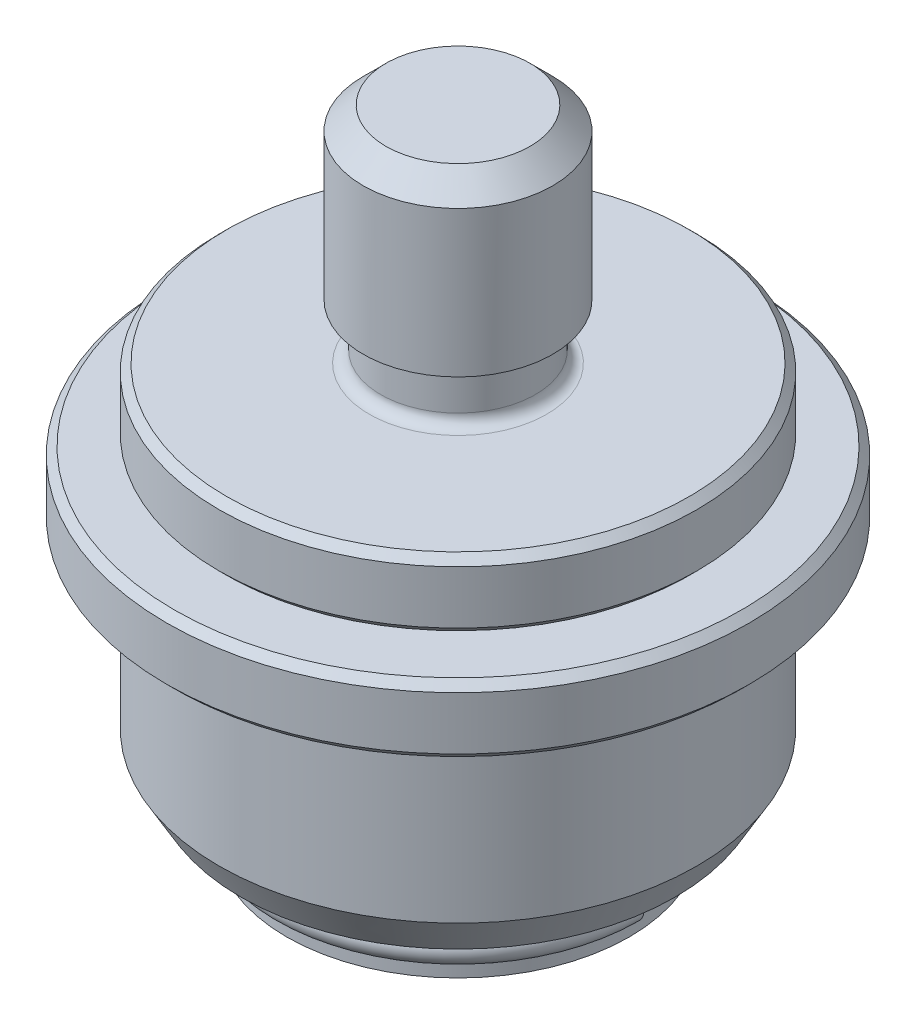
ISO-10303-21;
HEADER;
FILE_DESCRIPTION(('STEP AP214'),'2;1');
FILE_NAME('part.step','',(''),(''),'','','');
FILE_SCHEMA(('AUTOMOTIVE_DESIGN { 1 0 10303 214 1 1 1 1 }'));
ENDSEC;
DATA;
#1=APPLICATION_CONTEXT('core data for automotive mechanical design processes');
#2=APPLICATION_PROTOCOL_DEFINITION('international standard','automotive_design',2000,#1);
#3=PRODUCT_CONTEXT('',#1,'mechanical');
#4=PRODUCT('Part','Part','',(#3));
#5=PRODUCT_RELATED_PRODUCT_CATEGORY('part','',(#4));
#6=PRODUCT_DEFINITION_FORMATION('','',#4);
#7=PRODUCT_DEFINITION_CONTEXT('part definition',#1,'design');
#8=PRODUCT_DEFINITION('design','',#6,#7);
#9=PRODUCT_DEFINITION_SHAPE('','',#8);
#10=(LENGTH_UNIT() NAMED_UNIT(*) SI_UNIT(.MILLI.,.METRE.));
#11=(NAMED_UNIT(*) PLANE_ANGLE_UNIT() SI_UNIT($,.RADIAN.));
#12=(NAMED_UNIT(*) SI_UNIT($,.STERADIAN.) SOLID_ANGLE_UNIT());
#13=UNCERTAINTY_MEASURE_WITH_UNIT(LENGTH_MEASURE(1.E-05),#10,'distance_accuracy_value','');
#14=(GEOMETRIC_REPRESENTATION_CONTEXT(3) GLOBAL_UNCERTAINTY_ASSIGNED_CONTEXT((#13)) GLOBAL_UNIT_ASSIGNED_CONTEXT((#10,
#11,#12)) REPRESENTATION_CONTEXT('',''));
#15=CARTESIAN_POINT('',(0.,0.,0.));
#16=DIRECTION('',(0.,0.,1.));
#17=DIRECTION('',(1.,0.,0.));
#18=AXIS2_PLACEMENT_3D('',#15,#16,#17);
#19=CARTESIAN_POINT('',(0.,-25.5778,0.));
#20=DIRECTION('',(0.,1.,0.));
#21=DIRECTION('',(0.,0.,1.));
#22=AXIS2_PLACEMENT_3D('',#19,#20,#21);
#23=TOROIDAL_SURFACE('',#22,11.4808,0.9652);
#24=CARTESIAN_POINT('',(8.11815153344662,-25.5778,-8.11815153344642));
#25=DIRECTION('',(0.707106781186539,0.,0.707106781186556));
#26=DIRECTION('',(0.707106781186556,0.,-0.707106781186539));
#27=AXIS2_PLACEMENT_3D('',#24,#25,#26);
#28=CIRCLE('',#27,0.9652);
#29=CARTESIAN_POINT('',(8.80065099864788,-25.5778,-8.80065099864767));
#30=VERTEX_POINT('',#29);
#31=EDGE_CURVE('E11',#30,#30,#28,.T.);
#32=CARTESIAN_POINT('',(11.4808,-25.5778,0.));
#33=DIRECTION('',(0.,0.,1.));
#34=DIRECTION('',(1.,0.,0.));
#35=AXIS2_PLACEMENT_3D('',#32,#33,#34);
#36=CIRCLE('',#35,0.9652);
#37=CARTESIAN_POINT('',(12.446,-25.5778,0.));
#38=VERTEX_POINT('',#37);
#39=EDGE_CURVE('E44',#38,#38,#36,.T.);
#40=CARTESIAN_POINT('',(0.,-25.5778,0.));
#41=DIRECTION('',(0.,1.,0.));
#42=DIRECTION('',(0.,0.,1.));
#43=AXIS2_PLACEMENT_3D('',#40,#41,#42);
#44=CIRCLE('',#43,12.446);
#45=EDGE_CURVE('',#30,#38,#44,.T.);
#46=ORIENTED_EDGE('',*,*,#31,.F.);
#47=ORIENTED_EDGE('',*,*,#39,.T.);
#48=ORIENTED_EDGE('',*,*,#45,.T.);
#49=ORIENTED_EDGE('',*,*,#45,.F.);
#50=EDGE_LOOP('',(#46,#48,#47,#49));
#51=FACE_BOUND('',#50,.T.);
#52=ADVANCED_FACE('F38',(#51),#23,.T.);
#53=CARTESIAN_POINT('',(8.11815153344662,-25.5778,-8.11815153344642));
#54=DIRECTION('',(0.707106781186539,0.,0.707106781186556));
#55=DIRECTION('',(0.707106781186556,0.,-0.707106781186539));
#56=AXIS2_PLACEMENT_3D('',#53,#54,#55);
#57=PLANE('',#56);
#58=ORIENTED_EDGE('',*,*,#31,.T.);
#59=EDGE_LOOP('',(#58));
#60=FACE_BOUND('',#59,.T.);
#61=ADVANCED_FACE('F53',(#60),#57,.T.);
#62=CARTESIAN_POINT('',(11.4808,-25.5778,0.));
#63=DIRECTION('',(0.,0.,1.));
#64=DIRECTION('',(1.,0.,0.));
#65=AXIS2_PLACEMENT_3D('',#62,#63,#64);
#66=PLANE('',#65);
#67=ORIENTED_EDGE('',*,*,#39,.F.);
#68=EDGE_LOOP('',(#67));
#69=FACE_BOUND('',#68,.T.);
#70=ADVANCED_FACE('F51',(#69),#66,.F.);
#71=CLOSED_SHELL('',(#52,#61,#70));
#72=MANIFOLD_SOLID_BREP('B2',#71);
#73=CARTESIAN_POINT('',(19.5072,-4.826,0.));
#74=DIRECTION('',(0.,1.,0.));
#75=DIRECTION('',(0.,0.,1.));
#76=AXIS2_PLACEMENT_3D('',#73,#74,#75);
#77=PLANE('',#76);
#78=CARTESIAN_POINT('',(0.,-4.826,0.));
#79=DIRECTION('',(0.,1.,0.));
#80=DIRECTION('',(0.,0.,1.));
#81=AXIS2_PLACEMENT_3D('',#78,#79,#80);
#82=CIRCLE('',#81,18.9992);
#83=CARTESIAN_POINT('',(0.,-4.826,18.9992));
#84=VERTEX_POINT('',#83);
#85=EDGE_CURVE('E93',#84,#84,#82,.T.);
#86=ORIENTED_EDGE('',*,*,#85,.T.);
#87=EDGE_LOOP('',(#86));
#88=FACE_BOUND('',#87,.T.);
#89=CARTESIAN_POINT('',(0.,-4.826,0.));
#90=DIRECTION('',(0.,-1.,0.));
#91=DIRECTION('',(0.,0.,-1.));
#92=AXIS2_PLACEMENT_3D('',#89,#90,#91);
#93=CIRCLE('',#92,11.5316);
#94=CARTESIAN_POINT('',(0.,-4.826,-11.5316));
#95=VERTEX_POINT('',#94);
#96=EDGE_CURVE('E106',#95,#95,#93,.T.);
#97=ORIENTED_EDGE('',*,*,#96,.T.);
#98=EDGE_LOOP('',(#97));
#99=FACE_BOUND('',#98,.T.);
#100=ADVANCED_FACE('F86',(#88,#99),#77,.T.);
#101=CARTESIAN_POINT('',(0.,0.,0.));
#102=DIRECTION('',(0.,-1.,0.));
#103=DIRECTION('',(0.,0.,-1.));
#104=AXIS2_PLACEMENT_3D('',#101,#102,#103);
#105=CYLINDRICAL_SURFACE('',#104,11.5316);
#106=CARTESIAN_POINT('',(0.,-20.7264,0.));
#107=DIRECTION('',(0.,-1.,0.));
#108=DIRECTION('',(0.,0.,-1.));
#109=AXIS2_PLACEMENT_3D('',#106,#107,#108);
#110=CIRCLE('',#109,11.5316);
#111=CARTESIAN_POINT('',(0.,-20.7264,-11.5316));
#112=VERTEX_POINT('',#111);
#113=EDGE_CURVE('E109',#112,#112,#110,.T.);
#114=ORIENTED_EDGE('',*,*,#113,.T.);
#115=EDGE_LOOP('',(#114));
#116=FACE_BOUND('',#115,.T.);
#117=ORIENTED_EDGE('',*,*,#96,.F.);
#118=EDGE_LOOP('',(#117));
#119=FACE_BOUND('',#118,.T.);
#120=ADVANCED_FACE('F151',(#116,#119),#105,.F.);
#121=CARTESIAN_POINT('',(12.192,-20.7264,0.));
#122=DIRECTION('',(0.,-1.,0.));
#123=DIRECTION('',(0.,0.,-1.));
#124=AXIS2_PLACEMENT_3D('',#121,#122,#123);
#125=PLANE('',#124);
#126=CARTESIAN_POINT('',(0.,-20.7264,0.));
#127=DIRECTION('',(0.,-1.,0.));
#128=DIRECTION('',(0.,0.,-1.));
#129=AXIS2_PLACEMENT_3D('',#126,#127,#128);
#130=CIRCLE('',#129,12.192);
#131=CARTESIAN_POINT('',(0.,-20.7264,-12.192));
#132=VERTEX_POINT('',#131);
#133=EDGE_CURVE('E112',#132,#132,#130,.T.);
#134=ORIENTED_EDGE('',*,*,#133,.T.);
#135=EDGE_LOOP('',(#134));
#136=FACE_BOUND('',#135,.T.);
#137=ORIENTED_EDGE('',*,*,#113,.F.);
#138=EDGE_LOOP('',(#137));
#139=FACE_BOUND('',#138,.T.);
#140=ADVANCED_FACE('F156',(#136,#139),#125,.T.);
#141=CARTESIAN_POINT('',(0.,-21.7424,0.));
#142=DIRECTION('',(0.,-1.,0.));
#143=DIRECTION('',(0.,0.,-1.));
#144=AXIS2_PLACEMENT_3D('',#141,#142,#143);
#145=TOROIDAL_SURFACE('',#144,12.192,1.016);
#146=CARTESIAN_POINT('',(0.,-21.7424,0.));
#147=DIRECTION('',(0.,-1.,0.));
#148=DIRECTION('',(0.,0.,-1.));
#149=AXIS2_PLACEMENT_3D('',#146,#147,#148);
#150=CIRCLE('',#149,13.208);
#151=CARTESIAN_POINT('',(0.,-21.7424,-13.208));
#152=VERTEX_POINT('',#151);
#153=EDGE_CURVE('E115',#152,#152,#150,.T.);
#154=ORIENTED_EDGE('',*,*,#153,.T.);
#155=EDGE_LOOP('',(#154));
#156=FACE_BOUND('',#155,.T.);
#157=ORIENTED_EDGE('',*,*,#133,.F.);
#158=EDGE_LOOP('',(#157));
#159=FACE_BOUND('',#158,.T.);
#160=ADVANCED_FACE('F238',(#156,#159),#145,.F.);
#161=CARTESIAN_POINT('',(0.,0.,0.));
#162=DIRECTION('',(0.,-1.,0.));
#163=DIRECTION('',(0.,0.,-1.));
#164=AXIS2_PLACEMENT_3D('',#161,#162,#163);
#165=CYLINDRICAL_SURFACE('',#164,13.208);
#166=CARTESIAN_POINT('',(0.,-23.7236,0.));
#167=DIRECTION('',(0.,-1.,0.));
#168=DIRECTION('',(0.,0.,-1.));
#169=AXIS2_PLACEMENT_3D('',#166,#167,#168);
#170=CIRCLE('',#169,13.208);
#171=CARTESIAN_POINT('',(0.,-23.7236,-13.208));
#172=VERTEX_POINT('',#171);
#173=EDGE_CURVE('E118',#172,#172,#170,.T.);
#174=ORIENTED_EDGE('',*,*,#173,.T.);
#175=EDGE_LOOP('',(#174));
#176=FACE_BOUND('',#175,.T.);
#177=ORIENTED_EDGE('',*,*,#153,.F.);
#178=EDGE_LOOP('',(#177));
#179=FACE_BOUND('',#178,.T.);
#180=ADVANCED_FACE('F228',(#176,#179),#165,.F.);
#181=CARTESIAN_POINT('',(13.208,-23.7236,0.));
#182=DIRECTION('',(0.,-1.,0.));
#183=DIRECTION('',(0.,0.,-1.));
#184=AXIS2_PLACEMENT_3D('',#181,#182,#183);
#185=PLANE('',#184);
#186=CARTESIAN_POINT('',(0.,-23.7236,0.));
#187=DIRECTION('',(0.,-1.,0.));
#188=DIRECTION('',(0.,0.,-1.));
#189=AXIS2_PLACEMENT_3D('',#186,#187,#188);
#190=CIRCLE('',#189,14.5355303162583);
#191=CARTESIAN_POINT('',(0.,-23.7236,-14.5355303162583));
#192=VERTEX_POINT('',#191);
#193=EDGE_CURVE('E121',#192,#192,#190,.T.);
#194=ORIENTED_EDGE('',*,*,#193,.T.);
#195=EDGE_LOOP('',(#194));
#196=FACE_BOUND('',#195,.T.);
#197=ORIENTED_EDGE('',*,*,#173,.F.);
#198=EDGE_LOOP('',(#197));
#199=FACE_BOUND('',#198,.T.);
#200=ADVANCED_FACE('F218',(#196,#199),#185,.T.);
#201=CARTESIAN_POINT('',(0.,-23.7236,0.));
#202=DIRECTION('',(0.,1.,0.));
#203=DIRECTION('',(0.,0.,1.));
#204=AXIS2_PLACEMENT_3D('',#201,#202,#203);
#205=CONICAL_SURFACE('',#204,14.5355303162583,0.523598775598301);
#206=CARTESIAN_POINT('',(0.,-21.1836,0.));
#207=DIRECTION('',(0.,-1.,0.));
#208=DIRECTION('',(0.,0.,-1.));
#209=AXIS2_PLACEMENT_3D('',#206,#207,#208);
#210=CIRCLE('',#209,16.002);
#211=CARTESIAN_POINT('',(0.,-21.1836,-16.002));
#212=VERTEX_POINT('',#211);
#213=EDGE_CURVE('E124',#212,#212,#210,.T.);
#214=ORIENTED_EDGE('',*,*,#213,.T.);
#215=EDGE_LOOP('',(#214));
#216=FACE_BOUND('',#215,.T.);
#217=ORIENTED_EDGE('',*,*,#193,.F.);
#218=EDGE_LOOP('',(#217));
#219=FACE_BOUND('',#218,.T.);
#220=ADVANCED_FACE('F208',(#216,#219),#205,.T.);
#221=CARTESIAN_POINT('',(0.,0.,0.));
#222=DIRECTION('',(0.,-1.,0.));
#223=DIRECTION('',(0.,0.,-1.));
#224=AXIS2_PLACEMENT_3D('',#221,#222,#223);
#225=CYLINDRICAL_SURFACE('',#224,16.002);
#226=CARTESIAN_POINT('',(0.,-10.16,0.));
#227=DIRECTION('',(0.,-1.,0.));
#228=DIRECTION('',(0.,0.,-1.));
#229=AXIS2_PLACEMENT_3D('',#226,#227,#228);
#230=CIRCLE('',#229,16.002);
#231=CARTESIAN_POINT('',(0.,-10.16,-16.002));
#232=VERTEX_POINT('',#231);
#233=EDGE_CURVE('E127',#232,#232,#230,.T.);
#234=ORIENTED_EDGE('',*,*,#233,.T.);
#235=EDGE_LOOP('',(#234));
#236=FACE_BOUND('',#235,.T.);
#237=ORIENTED_EDGE('',*,*,#213,.F.);
#238=EDGE_LOOP('',(#237));
#239=FACE_BOUND('',#238,.T.);
#240=ADVANCED_FACE('F148',(#236,#239),#225,.T.);
#241=CARTESIAN_POINT('',(0.,-10.16,0.));
#242=DIRECTION('',(0.,-1.,0.));
#243=DIRECTION('',(0.,0.,-1.));
#244=AXIS2_PLACEMENT_3D('',#241,#242,#243);
#245=TOROIDAL_SURFACE('',#244,16.764,0.762);
#246=CARTESIAN_POINT('',(0.,-9.398,0.));
#247=DIRECTION('',(0.,-1.,0.));
#248=DIRECTION('',(0.,0.,-1.));
#249=AXIS2_PLACEMENT_3D('',#246,#247,#248);
#250=CIRCLE('',#249,16.764);
#251=CARTESIAN_POINT('',(0.,-9.398,-16.764));
#252=VERTEX_POINT('',#251);
#253=EDGE_CURVE('E130',#252,#252,#250,.T.);
#254=ORIENTED_EDGE('',*,*,#253,.T.);
#255=EDGE_LOOP('',(#254));
#256=FACE_BOUND('',#255,.T.);
#257=ORIENTED_EDGE('',*,*,#233,.F.);
#258=EDGE_LOOP('',(#257));
#259=FACE_BOUND('',#258,.T.);
#260=ADVANCED_FACE('F134',(#256,#259),#245,.F.);
#261=CARTESIAN_POINT('',(16.764,-9.398,0.));
#262=DIRECTION('',(0.,-1.,0.));
#263=DIRECTION('',(0.,0.,-1.));
#264=AXIS2_PLACEMENT_3D('',#261,#262,#263);
#265=PLANE('',#264);
#266=CARTESIAN_POINT('',(0.,-9.398,0.));
#267=DIRECTION('',(0.,-1.,0.));
#268=DIRECTION('',(0.,0.,-1.));
#269=AXIS2_PLACEMENT_3D('',#266,#267,#268);
#270=CIRCLE('',#269,18.9992);
#271=CARTESIAN_POINT('',(0.,-9.398,-18.9992));
#272=VERTEX_POINT('',#271);
#273=EDGE_CURVE('E37',#272,#272,#270,.T.);
#274=ORIENTED_EDGE('',*,*,#273,.T.);
#275=EDGE_LOOP('',(#274));
#276=FACE_BOUND('',#275,.T.);
#277=ORIENTED_EDGE('',*,*,#253,.F.);
#278=EDGE_LOOP('',(#277));
#279=FACE_BOUND('',#278,.T.);
#280=ADVANCED_FACE('F137',(#276,#279),#265,.T.);
#281=CARTESIAN_POINT('',(0.,0.,0.));
#282=DIRECTION('',(0.,-1.,0.));
#283=DIRECTION('',(0.,0.,-1.));
#284=AXIS2_PLACEMENT_3D('',#281,#282,#283);
#285=CYLINDRICAL_SURFACE('',#284,19.5072);
#286=CARTESIAN_POINT('',(0.,-5.334,0.));
#287=DIRECTION('',(0.,1.,0.));
#288=DIRECTION('',(0.,0.,1.));
#289=AXIS2_PLACEMENT_3D('',#286,#287,#288);
#290=CIRCLE('',#289,19.5072);
#291=CARTESIAN_POINT('',(0.,-5.334,19.5072));
#292=VERTEX_POINT('',#291);
#293=EDGE_CURVE('E97',#292,#292,#290,.F.);
#294=ORIENTED_EDGE('',*,*,#293,.T.);
#295=EDGE_LOOP('',(#294));
#296=FACE_BOUND('',#295,.T.);
#297=CARTESIAN_POINT('',(0.,-8.89,0.));
#298=DIRECTION('',(0.,-1.,0.));
#299=DIRECTION('',(0.,0.,-1.));
#300=AXIS2_PLACEMENT_3D('',#297,#298,#299);
#301=CIRCLE('',#300,19.5072);
#302=CARTESIAN_POINT('',(0.,-8.89,-19.5072));
#303=VERTEX_POINT('',#302);
#304=EDGE_CURVE('E101',#303,#303,#301,.F.);
#305=ORIENTED_EDGE('',*,*,#304,.T.);
#306=EDGE_LOOP('',(#305));
#307=FACE_BOUND('',#306,.T.);
#308=ADVANCED_FACE('F139',(#296,#307),#285,.T.);
#309=CARTESIAN_POINT('',(0.,-5.334,0.));
#310=DIRECTION('',(0.,-1.,0.));
#311=DIRECTION('',(0.,0.,-1.));
#312=AXIS2_PLACEMENT_3D('',#309,#310,#311);
#313=CONICAL_SURFACE('',#312,19.5072,0.785398163397455);
#314=ORIENTED_EDGE('',*,*,#85,.F.);
#315=EDGE_LOOP('',(#314));
#316=FACE_BOUND('',#315,.T.);
#317=ORIENTED_EDGE('',*,*,#293,.F.);
#318=EDGE_LOOP('',(#317));
#319=FACE_BOUND('',#318,.T.);
#320=ADVANCED_FACE('F145',(#316,#319),#313,.T.);
#321=CARTESIAN_POINT('',(0.,-9.398,0.));
#322=DIRECTION('',(0.,1.,0.));
#323=DIRECTION('',(0.,0.,1.));
#324=AXIS2_PLACEMENT_3D('',#321,#322,#323);
#325=CONICAL_SURFACE('',#324,18.9992,0.785398163397448);
#326=ORIENTED_EDGE('',*,*,#304,.F.);
#327=EDGE_LOOP('',(#326));
#328=FACE_BOUND('',#327,.T.);
#329=ORIENTED_EDGE('',*,*,#273,.F.);
#330=EDGE_LOOP('',(#329));
#331=FACE_BOUND('',#330,.T.);
#332=ADVANCED_FACE('F88',(#328,#331),#325,.T.);
#333=CLOSED_SHELL('',(#100,#120,#140,#160,#180,#200,#220,#240,#260,#280,#308,#320,#332));
#334=MANIFOLD_SOLID_BREP('B6',#333);
#335=CARTESIAN_POINT('',(0.,14.986,0.));
#336=DIRECTION('',(0.,1.,0.));
#337=DIRECTION('',(0.,0.,1.));
#338=AXIS2_PLACEMENT_3D('',#335,#336,#337);
#339=PLANE('',#338);
#340=CARTESIAN_POINT('',(0.,14.986,0.));
#341=DIRECTION('',(0.,1.,0.));
#342=DIRECTION('',(0.,0.,1.));
#343=AXIS2_PLACEMENT_3D('',#340,#341,#342);
#344=CIRCLE('',#343,4.826);
#345=CARTESIAN_POINT('',(0.,14.986,4.826));
#346=VERTEX_POINT('',#345);
#347=EDGE_CURVE('E85',#346,#346,#344,.T.);
#348=ORIENTED_EDGE('',*,*,#347,.T.);
#349=EDGE_LOOP('',(#348));
#350=FACE_BOUND('',#349,.T.);
#351=ADVANCED_FACE('F283',(#350),#339,.T.);
#352=CARTESIAN_POINT('',(0.,14.986,0.));
#353=DIRECTION('',(0.,-1.,0.));
#354=DIRECTION('',(0.,0.,-1.));
#355=AXIS2_PLACEMENT_3D('',#352,#353,#354);
#356=CYLINDRICAL_SURFACE('',#355,6.35);
#357=CARTESIAN_POINT('',(0.,13.462,0.));
#358=DIRECTION('',(0.,1.,0.));
#359=DIRECTION('',(0.,0.,1.));
#360=AXIS2_PLACEMENT_3D('',#357,#358,#359);
#361=CIRCLE('',#360,6.35);
#362=CARTESIAN_POINT('',(0.,13.462,6.35));
#363=VERTEX_POINT('',#362);
#364=EDGE_CURVE('E290',#363,#363,#361,.F.);
#365=ORIENTED_EDGE('',*,*,#364,.T.);
#366=EDGE_LOOP('',(#365));
#367=FACE_BOUND('',#366,.T.);
#368=CARTESIAN_POINT('',(0.,3.683,0.));
#369=DIRECTION('',(0.,-1.,0.));
#370=DIRECTION('',(0.,0.,-1.));
#371=AXIS2_PLACEMENT_3D('',#368,#369,#370);
#372=CIRCLE('',#371,6.35);
#373=CARTESIAN_POINT('',(0.,3.683,-6.35));
#374=VERTEX_POINT('',#373);
#375=EDGE_CURVE('E309',#374,#374,#372,.T.);
#376=ORIENTED_EDGE('',*,*,#375,.F.);
#377=EDGE_LOOP('',(#376));
#378=FACE_BOUND('',#377,.T.);
#379=ADVANCED_FACE('F363',(#367,#378),#356,.T.);
#380=CARTESIAN_POINT('',(6.35,3.683,0.));
#381=DIRECTION('',(0.,-1.,0.));
#382=DIRECTION('',(0.,0.,-1.));
#383=AXIS2_PLACEMENT_3D('',#380,#381,#382);
#384=PLANE('',#383);
#385=ORIENTED_EDGE('',*,*,#375,.T.);
#386=EDGE_LOOP('',(#385));
#387=FACE_BOUND('',#386,.T.);
#388=CARTESIAN_POINT('',(0.,3.683,0.));
#389=DIRECTION('',(0.,-1.,0.));
#390=DIRECTION('',(0.,0.,-1.));
#391=AXIS2_PLACEMENT_3D('',#388,#389,#390);
#392=CIRCLE('',#391,5.1816);
#393=CARTESIAN_POINT('',(0.,3.683,-5.1816));
#394=VERTEX_POINT('',#393);
#395=EDGE_CURVE('E312',#394,#394,#392,.T.);
#396=ORIENTED_EDGE('',*,*,#395,.F.);
#397=EDGE_LOOP('',(#396));
#398=FACE_BOUND('',#397,.T.);
#399=ADVANCED_FACE('F368',(#387,#398),#384,.T.);
#400=CARTESIAN_POINT('',(0.,14.986,0.));
#401=DIRECTION('',(0.,-1.,0.));
#402=DIRECTION('',(0.,0.,-1.));
#403=AXIS2_PLACEMENT_3D('',#400,#401,#402);
#404=CYLINDRICAL_SURFACE('',#403,5.1816);
#405=ORIENTED_EDGE('',*,*,#395,.T.);
#406=EDGE_LOOP('',(#405));
#407=FACE_BOUND('',#406,.T.);
#408=CARTESIAN_POINT('',(0.,0.762000000000006,0.));
#409=DIRECTION('',(0.,-1.,0.));
#410=DIRECTION('',(0.,0.,-1.));
#411=AXIS2_PLACEMENT_3D('',#408,#409,#410);
#412=CIRCLE('',#411,5.1816);
#413=CARTESIAN_POINT('',(0.,0.762000000000006,-5.1816));
#414=VERTEX_POINT('',#413);
#415=EDGE_CURVE('E315',#414,#414,#412,.T.);
#416=ORIENTED_EDGE('',*,*,#415,.F.);
#417=EDGE_LOOP('',(#416));
#418=FACE_BOUND('',#417,.T.);
#419=ADVANCED_FACE('F405',(#407,#418),#404,.T.);
#420=CARTESIAN_POINT('',(0.,0.762,0.));
#421=DIRECTION('',(0.,-1.,0.));
#422=DIRECTION('',(0.,0.,-1.));
#423=AXIS2_PLACEMENT_3D('',#420,#421,#422);
#424=TOROIDAL_SURFACE('',#423,5.9436,0.762);
#425=ORIENTED_EDGE('',*,*,#415,.T.);
#426=EDGE_LOOP('',(#425));
#427=FACE_BOUND('',#426,.T.);
#428=CARTESIAN_POINT('',(0.,0.,0.));
#429=DIRECTION('',(0.,-1.,0.));
#430=DIRECTION('',(0.,0.,-1.));
#431=AXIS2_PLACEMENT_3D('',#428,#429,#430);
#432=CIRCLE('',#431,5.94360000000001);
#433=CARTESIAN_POINT('',(0.,0.,-5.94360000000001));
#434=VERTEX_POINT('',#433);
#435=EDGE_CURVE('E318',#434,#434,#432,.T.);
#436=ORIENTED_EDGE('',*,*,#435,.F.);
#437=EDGE_LOOP('',(#436));
#438=FACE_BOUND('',#437,.T.);
#439=ADVANCED_FACE('F398',(#427,#438),#424,.F.);
#440=CARTESIAN_POINT('',(5.94360000000001,0.,0.));
#441=DIRECTION('',(0.,1.,0.));
#442=DIRECTION('',(0.,0.,1.));
#443=AXIS2_PLACEMENT_3D('',#440,#441,#442);
#444=PLANE('',#443);
#445=CARTESIAN_POINT('',(0.,0.,0.));
#446=DIRECTION('',(0.,1.,0.));
#447=DIRECTION('',(0.,0.,1.));
#448=AXIS2_PLACEMENT_3D('',#445,#446,#447);
#449=CIRCLE('',#448,15.494);
#450=CARTESIAN_POINT('',(0.,0.,15.494));
#451=VERTEX_POINT('',#450);
#452=EDGE_CURVE('E294',#451,#451,#449,.T.);
#453=ORIENTED_EDGE('',*,*,#452,.T.);
#454=EDGE_LOOP('',(#453));
#455=FACE_BOUND('',#454,.T.);
#456=ORIENTED_EDGE('',*,*,#435,.T.);
#457=EDGE_LOOP('',(#456));
#458=FACE_BOUND('',#457,.T.);
#459=ADVANCED_FACE('F388',(#455,#458),#444,.T.);
#460=CARTESIAN_POINT('',(0.,14.986,0.));
#461=DIRECTION('',(0.,-1.,0.));
#462=DIRECTION('',(0.,0.,-1.));
#463=AXIS2_PLACEMENT_3D('',#460,#461,#462);
#464=CYLINDRICAL_SURFACE('',#463,16.002);
#465=CARTESIAN_POINT('',(0.,-4.06399999999998,0.));
#466=DIRECTION('',(0.,-1.,0.));
#467=DIRECTION('',(0.,0.,-1.));
#468=AXIS2_PLACEMENT_3D('',#465,#466,#467);
#469=CIRCLE('',#468,16.002);
#470=CARTESIAN_POINT('',(0.,-4.06399999999998,-16.002));
#471=VERTEX_POINT('',#470);
#472=EDGE_CURVE('E298',#471,#471,#469,.F.);
#473=ORIENTED_EDGE('',*,*,#472,.T.);
#474=EDGE_LOOP('',(#473));
#475=FACE_BOUND('',#474,.T.);
#476=CARTESIAN_POINT('',(0.,-0.507999999999991,0.));
#477=DIRECTION('',(0.,1.,0.));
#478=DIRECTION('',(0.,0.,1.));
#479=AXIS2_PLACEMENT_3D('',#476,#477,#478);
#480=CIRCLE('',#479,16.002);
#481=CARTESIAN_POINT('',(0.,-0.507999999999991,16.002));
#482=VERTEX_POINT('',#481);
#483=EDGE_CURVE('E303',#482,#482,#480,.F.);
#484=ORIENTED_EDGE('',*,*,#483,.T.);
#485=EDGE_LOOP('',(#484));
#486=FACE_BOUND('',#485,.T.);
#487=ADVANCED_FACE('F385',(#475,#486),#464,.T.);
#488=CARTESIAN_POINT('',(16.002,-4.572,0.));
#489=DIRECTION('',(0.,-1.,0.));
#490=DIRECTION('',(0.,0.,-1.));
#491=AXIS2_PLACEMENT_3D('',#488,#489,#490);
#492=PLANE('',#491);
#493=CARTESIAN_POINT('',(0.,-4.572,0.));
#494=DIRECTION('',(0.,-1.,0.));
#495=DIRECTION('',(0.,0.,-1.));
#496=AXIS2_PLACEMENT_3D('',#493,#494,#495);
#497=CIRCLE('',#496,15.494);
#498=CARTESIAN_POINT('',(0.,-4.572,-15.494));
#499=VERTEX_POINT('',#498);
#500=EDGE_CURVE('E306',#499,#499,#497,.T.);
#501=ORIENTED_EDGE('',*,*,#500,.T.);
#502=EDGE_LOOP('',(#501));
#503=FACE_BOUND('',#502,.T.);
#504=CARTESIAN_POINT('',(0.,-4.572,0.));
#505=DIRECTION('',(0.,-1.,0.));
#506=DIRECTION('',(0.,0.,-1.));
#507=AXIS2_PLACEMENT_3D('',#504,#505,#506);
#508=CIRCLE('',#507,11.4808);
#509=CARTESIAN_POINT('',(0.,-4.572,-11.4808));
#510=VERTEX_POINT('',#509);
#511=EDGE_CURVE('E321',#510,#510,#508,.T.);
#512=ORIENTED_EDGE('',*,*,#511,.F.);
#513=EDGE_LOOP('',(#512));
#514=FACE_BOUND('',#513,.T.);
#515=ADVANCED_FACE('F387',(#503,#514),#492,.T.);
#516=CARTESIAN_POINT('',(0.,14.986,0.));
#517=DIRECTION('',(0.,-1.,0.));
#518=DIRECTION('',(0.,0.,-1.));
#519=AXIS2_PLACEMENT_3D('',#516,#517,#518);
#520=CYLINDRICAL_SURFACE('',#519,11.4808);
#521=ORIENTED_EDGE('',*,*,#511,.T.);
#522=EDGE_LOOP('',(#521));
#523=FACE_BOUND('',#522,.T.);
#524=CARTESIAN_POINT('',(0.,-24.5618,0.));
#525=DIRECTION('',(0.,-1.,0.));
#526=DIRECTION('',(0.,0.,-1.));
#527=AXIS2_PLACEMENT_3D('',#524,#525,#526);
#528=CIRCLE('',#527,11.4808);
#529=CARTESIAN_POINT('',(0.,-24.5618,-11.4808));
#530=VERTEX_POINT('',#529);
#531=EDGE_CURVE('E324',#530,#530,#528,.T.);
#532=ORIENTED_EDGE('',*,*,#531,.F.);
#533=EDGE_LOOP('',(#532));
#534=FACE_BOUND('',#533,.T.);
#535=ADVANCED_FACE('F395',(#523,#534),#520,.T.);
#536=CARTESIAN_POINT('',(0.,-25.5778,0.));
#537=DIRECTION('',(0.,-1.,0.));
#538=DIRECTION('',(0.,0.,-1.));
#539=AXIS2_PLACEMENT_3D('',#536,#537,#538);
#540=TOROIDAL_SURFACE('',#539,11.4808,1.016);
#541=ORIENTED_EDGE('',*,*,#531,.T.);
#542=EDGE_LOOP('',(#541));
#543=FACE_BOUND('',#542,.T.);
#544=CARTESIAN_POINT('',(0.,-26.5938,0.));
#545=DIRECTION('',(0.,-1.,0.));
#546=DIRECTION('',(0.,0.,-1.));
#547=AXIS2_PLACEMENT_3D('',#544,#545,#546);
#548=CIRCLE('',#547,11.4808);
#549=CARTESIAN_POINT('',(0.,-26.5938,-11.4808));
#550=VERTEX_POINT('',#549);
#551=EDGE_CURVE('E327',#550,#550,#548,.T.);
#552=ORIENTED_EDGE('',*,*,#551,.F.);
#553=EDGE_LOOP('',(#552));
#554=FACE_BOUND('',#553,.T.);
#555=ADVANCED_FACE('F522',(#543,#554),#540,.F.);
#556=CARTESIAN_POINT('',(0.,14.986,0.));
#557=DIRECTION('',(0.,-1.,0.));
#558=DIRECTION('',(0.,0.,-1.));
#559=AXIS2_PLACEMENT_3D('',#556,#557,#558);
#560=CYLINDRICAL_SURFACE('',#559,11.4808);
#561=ORIENTED_EDGE('',*,*,#551,.T.);
#562=EDGE_LOOP('',(#561));
#563=FACE_BOUND('',#562,.T.);
#564=CARTESIAN_POINT('',(0.,-27.559,0.));
#565=DIRECTION('',(0.,-1.,0.));
#566=DIRECTION('',(0.,0.,-1.));
#567=AXIS2_PLACEMENT_3D('',#564,#565,#566);
#568=CIRCLE('',#567,11.4808);
#569=CARTESIAN_POINT('',(0.,-27.559,-11.4808));
#570=VERTEX_POINT('',#569);
#571=EDGE_CURVE('E330',#570,#570,#568,.T.);
#572=ORIENTED_EDGE('',*,*,#571,.F.);
#573=EDGE_LOOP('',(#572));
#574=FACE_BOUND('',#573,.T.);
#575=ADVANCED_FACE('F513',(#563,#574),#560,.T.);
#576=CARTESIAN_POINT('',(11.4808,-27.559,0.));
#577=DIRECTION('',(0.,-1.,0.));
#578=DIRECTION('',(0.,0.,-1.));
#579=AXIS2_PLACEMENT_3D('',#576,#577,#578);
#580=PLANE('',#579);
#581=ORIENTED_EDGE('',*,*,#571,.T.);
#582=EDGE_LOOP('',(#581));
#583=FACE_BOUND('',#582,.T.);
#584=CARTESIAN_POINT('',(0.,-27.559,0.));
#585=DIRECTION('',(0.,-1.,0.));
#586=DIRECTION('',(0.,0.,-1.));
#587=AXIS2_PLACEMENT_3D('',#584,#585,#586);
#588=CIRCLE('',#587,9.55040000000001);
#589=CARTESIAN_POINT('',(0.,-27.559,-9.55040000000001));
#590=VERTEX_POINT('',#589);
#591=EDGE_CURVE('E333',#590,#590,#588,.T.);
#592=ORIENTED_EDGE('',*,*,#591,.F.);
#593=EDGE_LOOP('',(#592));
#594=FACE_BOUND('',#593,.T.);
#595=ADVANCED_FACE('F504',(#583,#594),#580,.T.);
#596=CARTESIAN_POINT('',(0.,-26.035,0.));
#597=DIRECTION('',(0.,-1.,0.));
#598=DIRECTION('',(0.,0.,-1.));
#599=AXIS2_PLACEMENT_3D('',#596,#597,#598);
#600=TOROIDAL_SURFACE('',#599,9.5504,1.524);
#601=ORIENTED_EDGE('',*,*,#591,.T.);
#602=EDGE_LOOP('',(#601));
#603=FACE_BOUND('',#602,.T.);
#604=CARTESIAN_POINT('',(0.,-26.035,0.));
#605=DIRECTION('',(0.,-1.,0.));
#606=DIRECTION('',(0.,0.,-1.));
#607=AXIS2_PLACEMENT_3D('',#604,#605,#606);
#608=CIRCLE('',#607,8.0264);
#609=CARTESIAN_POINT('',(0.,-26.035,-8.0264));
#610=VERTEX_POINT('',#609);
#611=EDGE_CURVE('E336',#610,#610,#608,.T.);
#612=ORIENTED_EDGE('',*,*,#611,.F.);
#613=EDGE_LOOP('',(#612));
#614=FACE_BOUND('',#613,.T.);
#615=ADVANCED_FACE('F359',(#603,#614),#600,.T.);
#616=CARTESIAN_POINT('',(0.,14.986,0.));
#617=DIRECTION('',(0.,-1.,0.));
#618=DIRECTION('',(0.,0.,-1.));
#619=AXIS2_PLACEMENT_3D('',#616,#617,#618);
#620=CYLINDRICAL_SURFACE('',#619,8.0264);
#621=ORIENTED_EDGE('',*,*,#611,.T.);
#622=EDGE_LOOP('',(#621));
#623=FACE_BOUND('',#622,.T.);
#624=CARTESIAN_POINT('',(0.,-20.066,0.));
#625=DIRECTION('',(0.,-1.,0.));
#626=DIRECTION('',(0.,0.,-1.));
#627=AXIS2_PLACEMENT_3D('',#624,#625,#626);
#628=CIRCLE('',#627,8.0264);
#629=CARTESIAN_POINT('',(0.,-20.066,-8.0264));
#630=VERTEX_POINT('',#629);
#631=EDGE_CURVE('E339',#630,#630,#628,.T.);
#632=ORIENTED_EDGE('',*,*,#631,.F.);
#633=EDGE_LOOP('',(#632));
#634=FACE_BOUND('',#633,.T.);
#635=ADVANCED_FACE('F350',(#623,#634),#620,.F.);
#636=CARTESIAN_POINT('',(0.,-15.5321,0.));
#637=DIRECTION('',(0.,-1.,0.));
#638=DIRECTION('',(0.,0.,-1.));
#639=AXIS2_PLACEMENT_3D('',#636,#637,#638);
#640=CONICAL_SURFACE('',#639,3.4925,0.78539816339745);
#641=ORIENTED_EDGE('',*,*,#631,.T.);
#642=EDGE_LOOP('',(#641));
#643=FACE_BOUND('',#642,.T.);
#644=CARTESIAN_POINT('',(0.,-15.5321,0.));
#645=DIRECTION('',(0.,-1.,0.));
#646=DIRECTION('',(0.,0.,-1.));
#647=AXIS2_PLACEMENT_3D('',#644,#645,#646);
#648=CIRCLE('',#647,3.4925);
#649=CARTESIAN_POINT('',(0.,-15.5321,-3.4925));
#650=VERTEX_POINT('',#649);
#651=EDGE_CURVE('E342',#650,#650,#648,.T.);
#652=ORIENTED_EDGE('',*,*,#651,.F.);
#653=EDGE_LOOP('',(#652));
#654=FACE_BOUND('',#653,.T.);
#655=ADVANCED_FACE('F348',(#643,#654),#640,.F.);
#656=CARTESIAN_POINT('',(3.4925,-15.5321,0.));
#657=DIRECTION('',(0.,-1.,0.));
#658=DIRECTION('',(0.,0.,-1.));
#659=AXIS2_PLACEMENT_3D('',#656,#657,#658);
#660=PLANE('',#659);
#661=ORIENTED_EDGE('',*,*,#651,.T.);
#662=EDGE_LOOP('',(#661));
#663=FACE_BOUND('',#662,.T.);
#664=ADVANCED_FACE('F346',(#663),#660,.T.);
#665=CARTESIAN_POINT('',(0.,-4.572,0.));
#666=DIRECTION('',(0.,1.,0.));
#667=DIRECTION('',(0.,0.,1.));
#668=AXIS2_PLACEMENT_3D('',#665,#666,#667);
#669=CONICAL_SURFACE('',#668,15.494,0.785398163397438);
#670=ORIENTED_EDGE('',*,*,#472,.F.);
#671=EDGE_LOOP('',(#670));
#672=FACE_BOUND('',#671,.T.);
#673=ORIENTED_EDGE('',*,*,#500,.F.);
#674=EDGE_LOOP('',(#673));
#675=FACE_BOUND('',#674,.T.);
#676=ADVANCED_FACE('F357',(#672,#675),#669,.T.);
#677=CARTESIAN_POINT('',(0.,-0.507999999999991,0.));
#678=DIRECTION('',(0.,-1.,0.));
#679=DIRECTION('',(0.,0.,-1.));
#680=AXIS2_PLACEMENT_3D('',#677,#678,#679);
#681=CONICAL_SURFACE('',#680,16.002,0.785398163397448);
#682=ORIENTED_EDGE('',*,*,#452,.F.);
#683=EDGE_LOOP('',(#682));
#684=FACE_BOUND('',#683,.T.);
#685=ORIENTED_EDGE('',*,*,#483,.F.);
#686=EDGE_LOOP('',(#685));
#687=FACE_BOUND('',#686,.T.);
#688=ADVANCED_FACE('F373',(#684,#687),#681,.T.);
#689=CARTESIAN_POINT('',(0.,13.462,0.));
#690=DIRECTION('',(0.,-1.,0.));
#691=DIRECTION('',(0.,0.,-1.));
#692=AXIS2_PLACEMENT_3D('',#689,#690,#691);
#693=CONICAL_SURFACE('',#692,6.35,0.785398163397448);
#694=ORIENTED_EDGE('',*,*,#347,.F.);
#695=EDGE_LOOP('',(#694));
#696=FACE_BOUND('',#695,.T.);
#697=ORIENTED_EDGE('',*,*,#364,.F.);
#698=EDGE_LOOP('',(#697));
#699=FACE_BOUND('',#698,.T.);
#700=ADVANCED_FACE('F285',(#696,#699),#693,.T.);
#701=CLOSED_SHELL('',(#351,#379,#399,#419,#439,#459,#487,#515,#535,#555,#575,#595,#615,#635,
#655,#664,#676,#688,#700));
#702=MANIFOLD_SOLID_BREP('B32',#701);
#703=ADVANCED_BREP_SHAPE_REPRESENTATION('',(#18,#72,#334,#702),#14);
#704=SHAPE_DEFINITION_REPRESENTATION(#9,#703);
ENDSEC;
END-ISO-10303-21;
